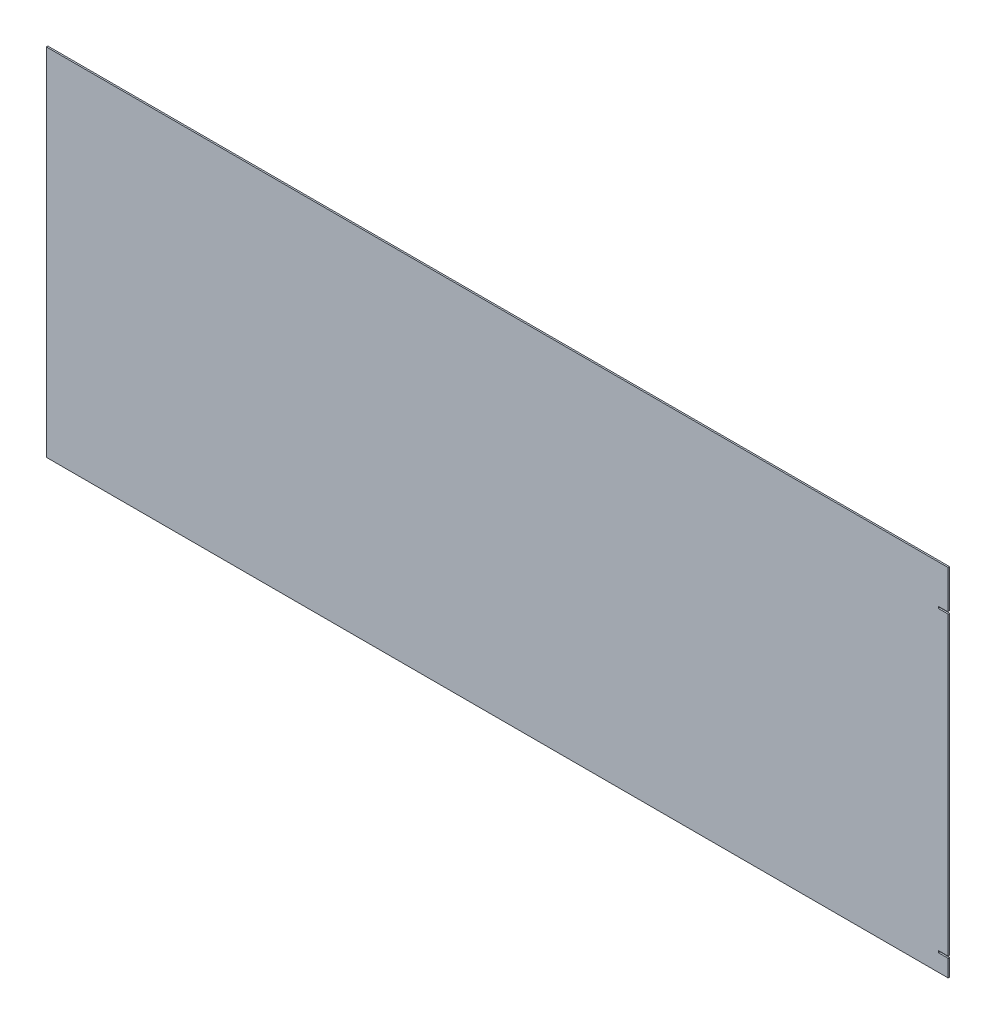
ISO-10303-21;
HEADER;
FILE_DESCRIPTION(('STEP AP214'),'2;1');
FILE_NAME('part.step','',(''),(''),'','','');
FILE_SCHEMA(('AUTOMOTIVE_DESIGN { 1 0 10303 214 1 1 1 1 }'));
ENDSEC;
DATA;
#1=APPLICATION_CONTEXT('core data for automotive mechanical design processes');
#2=APPLICATION_PROTOCOL_DEFINITION('international standard','automotive_design',2000,#1);
#3=PRODUCT_CONTEXT('',#1,'mechanical');
#4=PRODUCT('Part','Part','',(#3));
#5=PRODUCT_RELATED_PRODUCT_CATEGORY('part','',(#4));
#6=PRODUCT_DEFINITION_FORMATION('','',#4);
#7=PRODUCT_DEFINITION_CONTEXT('part definition',#1,'design');
#8=PRODUCT_DEFINITION('design','',#6,#7);
#9=PRODUCT_DEFINITION_SHAPE('','',#8);
#10=(LENGTH_UNIT() NAMED_UNIT(*) SI_UNIT(.MILLI.,.METRE.));
#11=(NAMED_UNIT(*) PLANE_ANGLE_UNIT() SI_UNIT($,.RADIAN.));
#12=(NAMED_UNIT(*) SI_UNIT($,.STERADIAN.) SOLID_ANGLE_UNIT());
#13=UNCERTAINTY_MEASURE_WITH_UNIT(LENGTH_MEASURE(1.E-05),#10,'distance_accuracy_value','');
#14=(GEOMETRIC_REPRESENTATION_CONTEXT(3) GLOBAL_UNCERTAINTY_ASSIGNED_CONTEXT((#13)) GLOBAL_UNIT_ASSIGNED_CONTEXT((#10,
#11,#12)) REPRESENTATION_CONTEXT('',''));
#15=CARTESIAN_POINT('',(0.,0.,0.));
#16=DIRECTION('',(0.,0.,1.));
#17=DIRECTION('',(1.,0.,0.));
#18=AXIS2_PLACEMENT_3D('',#15,#16,#17);
#19=CARTESIAN_POINT('',(600.,-236.5,-2.));
#20=DIRECTION('',(1.,0.,0.));
#21=DIRECTION('',(0.,0.,-1.));
#22=AXIS2_PLACEMENT_3D('',#19,#20,#21);
#23=PLANE('',#22);
#24=DIRECTION('',(0.,1.,0.));
#25=VECTOR('',#24,1.);
#26=CARTESIAN_POINT('',(600.,-236.5,0.));
#27=LINE('',#26,#25);
#28=CARTESIAN_POINT('',(600.,186.050514081919,0.));
#29=VERTEX_POINT('',#28);
#30=CARTESIAN_POINT('',(600.,236.5,0.));
#31=VERTEX_POINT('',#30);
#32=EDGE_CURVE('E240',#29,#31,#27,.T.);
#33=ORIENTED_EDGE('',*,*,#32,.F.);
#34=DIRECTION('',(0.,0.,1.));
#35=VECTOR('',#34,1.);
#36=CARTESIAN_POINT('',(600.,186.050514081919,-2.));
#37=LINE('',#36,#35);
#38=CARTESIAN_POINT('',(600.,186.050514081919,-2.));
#39=VERTEX_POINT('',#38);
#40=EDGE_CURVE('E11',#29,#39,#37,.F.);
#41=ORIENTED_EDGE('',*,*,#40,.T.);
#42=DIRECTION('',(0.,1.,0.));
#43=VECTOR('',#42,1.);
#44=CARTESIAN_POINT('',(600.,-236.5,-2.));
#45=LINE('',#44,#43);
#46=CARTESIAN_POINT('',(600.,236.5,-2.));
#47=VERTEX_POINT('',#46);
#48=EDGE_CURVE('E220',#39,#47,#45,.T.);
#49=ORIENTED_EDGE('',*,*,#48,.T.);
#50=DIRECTION('',(0.,0.,1.));
#51=VECTOR('',#50,1.);
#52=CARTESIAN_POINT('',(600.,236.5,-2.));
#53=LINE('',#52,#51);
#54=EDGE_CURVE('E251',#47,#31,#53,.T.);
#55=ORIENTED_EDGE('',*,*,#54,.T.);
#56=EDGE_LOOP('',(#33,#41,#49,#55));
#57=FACE_BOUND('',#56,.T.);
#58=ADVANCED_FACE('F42',(#57),#23,.T.);
#59=DIRECTION('',(0.,0.,-1.));
#60=VECTOR('',#59,1.);
#61=CARTESIAN_POINT('',(600.,182.810514081919,0.));
#62=LINE('',#61,#60);
#63=CARTESIAN_POINT('',(600.,182.810514081919,0.));
#64=VERTEX_POINT('',#63);
#65=CARTESIAN_POINT('',(600.,182.810514081919,-2.));
#66=VERTEX_POINT('',#65);
#67=EDGE_CURVE('E162',#64,#66,#62,.T.);
#68=ORIENTED_EDGE('',*,*,#67,.F.);
#69=CARTESIAN_POINT('',(600.,-211.320674279277,0.));
#70=VERTEX_POINT('',#69);
#71=EDGE_CURVE('E169',#70,#64,#27,.T.);
#72=ORIENTED_EDGE('',*,*,#71,.F.);
#73=DIRECTION('',(0.,0.,1.));
#74=VECTOR('',#73,1.);
#75=CARTESIAN_POINT('',(600.,-211.320674279277,0.));
#76=LINE('',#75,#74);
#77=CARTESIAN_POINT('',(600.,-211.320674279277,-2.));
#78=VERTEX_POINT('',#77);
#79=EDGE_CURVE('E195',#78,#70,#76,.T.);
#80=ORIENTED_EDGE('',*,*,#79,.F.);
#81=EDGE_CURVE('E226',#78,#66,#45,.T.);
#82=ORIENTED_EDGE('',*,*,#81,.T.);
#83=EDGE_LOOP('',(#68,#72,#80,#82));
#84=FACE_BOUND('',#83,.T.);
#85=ADVANCED_FACE('F321',(#84),#23,.T.);
#86=CARTESIAN_POINT('',(-600.,-236.5,-2.));
#87=DIRECTION('',(-1.,0.,0.));
#88=DIRECTION('',(0.,0.,1.));
#89=AXIS2_PLACEMENT_3D('',#86,#87,#88);
#90=PLANE('',#89);
#91=DIRECTION('',(0.,-1.,0.));
#92=VECTOR('',#91,1.);
#93=CARTESIAN_POINT('',(-600.,-236.5,0.));
#94=LINE('',#93,#92);
#95=CARTESIAN_POINT('',(-600.,236.5,0.));
#96=VERTEX_POINT('',#95);
#97=CARTESIAN_POINT('',(-600.,-236.5,0.));
#98=VERTEX_POINT('',#97);
#99=EDGE_CURVE('E231',#96,#98,#94,.T.);
#100=ORIENTED_EDGE('',*,*,#99,.F.);
#101=DIRECTION('',(0.,0.,1.));
#102=VECTOR('',#101,1.);
#103=CARTESIAN_POINT('',(-600.,236.5,-2.));
#104=LINE('',#103,#102);
#105=CARTESIAN_POINT('',(-600.,236.5,-2.));
#106=VERTEX_POINT('',#105);
#107=EDGE_CURVE('E247',#106,#96,#104,.T.);
#108=ORIENTED_EDGE('',*,*,#107,.F.);
#109=DIRECTION('',(0.,-1.,0.));
#110=VECTOR('',#109,1.);
#111=CARTESIAN_POINT('',(-600.,-236.5,-2.));
#112=LINE('',#111,#110);
#113=CARTESIAN_POINT('',(-600.,-236.5,-2.));
#114=VERTEX_POINT('',#113);
#115=EDGE_CURVE('E211',#106,#114,#112,.T.);
#116=ORIENTED_EDGE('',*,*,#115,.T.);
#117=DIRECTION('',(0.,0.,1.));
#118=VECTOR('',#117,1.);
#119=CARTESIAN_POINT('',(-600.,-236.5,-2.));
#120=LINE('',#119,#118);
#121=EDGE_CURVE('E230',#114,#98,#120,.T.);
#122=ORIENTED_EDGE('',*,*,#121,.T.);
#123=EDGE_LOOP('',(#100,#108,#116,#122));
#124=FACE_BOUND('',#123,.T.);
#125=ADVANCED_FACE('F350',(#124),#90,.T.);
#126=CARTESIAN_POINT('',(600.,236.5,-2.));
#127=DIRECTION('',(0.,1.,0.));
#128=DIRECTION('',(-1.,0.,0.));
#129=AXIS2_PLACEMENT_3D('',#126,#127,#128);
#130=PLANE('',#129);
#131=DIRECTION('',(-1.,0.,0.));
#132=VECTOR('',#131,1.);
#133=CARTESIAN_POINT('',(600.,236.5,0.));
#134=LINE('',#133,#132);
#135=EDGE_CURVE('E216',#31,#96,#134,.T.);
#136=ORIENTED_EDGE('',*,*,#135,.F.);
#137=ORIENTED_EDGE('',*,*,#54,.F.);
#138=DIRECTION('',(-1.,0.,0.));
#139=VECTOR('',#138,1.);
#140=CARTESIAN_POINT('',(600.,236.5,-2.));
#141=LINE('',#140,#139);
#142=EDGE_CURVE('E225',#47,#106,#141,.T.);
#143=ORIENTED_EDGE('',*,*,#142,.T.);
#144=ORIENTED_EDGE('',*,*,#107,.T.);
#145=EDGE_LOOP('',(#136,#137,#143,#144));
#146=FACE_BOUND('',#145,.T.);
#147=ADVANCED_FACE('F352',(#146),#130,.T.);
#148=CARTESIAN_POINT('',(600.,-236.5,-2.));
#149=VERTEX_POINT('',#148);
#150=CARTESIAN_POINT('',(600.,-214.560674279277,-2.));
#151=VERTEX_POINT('',#150);
#152=EDGE_CURVE('E221',#149,#151,#45,.T.);
#153=ORIENTED_EDGE('',*,*,#152,.T.);
#154=DIRECTION('',(0.,0.,-1.));
#155=VECTOR('',#154,1.);
#156=CARTESIAN_POINT('',(600.,-214.560674279277,0.));
#157=LINE('',#156,#155);
#158=CARTESIAN_POINT('',(600.,-214.560674279277,0.));
#159=VERTEX_POINT('',#158);
#160=EDGE_CURVE('E269',#151,#159,#157,.F.);
#161=ORIENTED_EDGE('',*,*,#160,.T.);
#162=CARTESIAN_POINT('',(600.,-236.5,0.));
#163=VERTEX_POINT('',#162);
#164=EDGE_CURVE('E241',#163,#159,#27,.T.);
#165=ORIENTED_EDGE('',*,*,#164,.F.);
#166=DIRECTION('',(0.,0.,1.));
#167=VECTOR('',#166,1.);
#168=CARTESIAN_POINT('',(600.,-236.5,-2.));
#169=LINE('',#168,#167);
#170=EDGE_CURVE('E255',#149,#163,#169,.T.);
#171=ORIENTED_EDGE('',*,*,#170,.F.);
#172=EDGE_LOOP('',(#153,#161,#165,#171));
#173=FACE_BOUND('',#172,.T.);
#174=ADVANCED_FACE('F340',(#173),#23,.T.);
#175=CARTESIAN_POINT('',(600.,-236.5,-2.));
#176=DIRECTION('',(0.,-1.,0.));
#177=DIRECTION('',(1.,0.,0.));
#178=AXIS2_PLACEMENT_3D('',#175,#176,#177);
#179=PLANE('',#178);
#180=DIRECTION('',(1.,0.,0.));
#181=VECTOR('',#180,1.);
#182=CARTESIAN_POINT('',(600.,-236.5,0.));
#183=LINE('',#182,#181);
#184=EDGE_CURVE('E235',#98,#163,#183,.T.);
#185=ORIENTED_EDGE('',*,*,#184,.F.);
#186=ORIENTED_EDGE('',*,*,#121,.F.);
#187=DIRECTION('',(1.,0.,0.));
#188=VECTOR('',#187,1.);
#189=CARTESIAN_POINT('',(600.,-236.5,-2.));
#190=LINE('',#189,#188);
#191=EDGE_CURVE('E215',#114,#149,#190,.T.);
#192=ORIENTED_EDGE('',*,*,#191,.T.);
#193=ORIENTED_EDGE('',*,*,#170,.T.);
#194=EDGE_LOOP('',(#185,#186,#192,#193));
#195=FACE_BOUND('',#194,.T.);
#196=ADVANCED_FACE('F347',(#195),#179,.T.);
#197=CARTESIAN_POINT('',(0.,0.,-2.));
#198=DIRECTION('',(0.,0.,1.));
#199=DIRECTION('',(1.,0.,0.));
#200=AXIS2_PLACEMENT_3D('',#197,#198,#199);
#201=PLANE('',#200);
#202=DIRECTION('',(1.,0.,0.));
#203=VECTOR('',#202,1.);
#204=CARTESIAN_POINT('',(587.,-213.820674279277,-2.));
#205=LINE('',#204,#203);
#206=CARTESIAN_POINT('',(587.,-213.820674279277,-2.));
#207=VERTEX_POINT('',#206);
#208=CARTESIAN_POINT('',(599.26,-213.820674279277,-2.));
#209=VERTEX_POINT('',#208);
#210=EDGE_CURVE('E185',#207,#209,#205,.T.);
#211=ORIENTED_EDGE('',*,*,#210,.T.);
#212=CARTESIAN_POINT('',(599.26,-214.560674279277,-2.));
#213=DIRECTION('',(0.,0.,1.));
#214=DIRECTION('',(1.,0.,0.));
#215=AXIS2_PLACEMENT_3D('',#212,#213,#214);
#216=CIRCLE('',#215,0.74);
#217=EDGE_CURVE('E266',#209,#151,#216,.F.);
#218=ORIENTED_EDGE('',*,*,#217,.T.);
#219=ORIENTED_EDGE('',*,*,#152,.F.);
#220=ORIENTED_EDGE('',*,*,#191,.F.);
#221=ORIENTED_EDGE('',*,*,#115,.F.);
#222=ORIENTED_EDGE('',*,*,#142,.F.);
#223=ORIENTED_EDGE('',*,*,#48,.F.);
#224=CARTESIAN_POINT('',(599.26,186.050514081919,-2.));
#225=DIRECTION('',(0.,0.,1.));
#226=DIRECTION('',(1.,0.,0.));
#227=AXIS2_PLACEMENT_3D('',#224,#225,#226);
#228=CIRCLE('',#227,0.74);
#229=CARTESIAN_POINT('',(599.26,185.310514081919,-2.));
#230=VERTEX_POINT('',#229);
#231=EDGE_CURVE('E263',#39,#230,#228,.F.);
#232=ORIENTED_EDGE('',*,*,#231,.T.);
#233=DIRECTION('',(1.,0.,0.));
#234=VECTOR('',#233,1.);
#235=CARTESIAN_POINT('',(587.,185.310514081919,-2.));
#236=LINE('',#235,#234);
#237=CARTESIAN_POINT('',(587.,185.310514081919,-2.));
#238=VERTEX_POINT('',#237);
#239=EDGE_CURVE('E174',#238,#230,#236,.T.);
#240=ORIENTED_EDGE('',*,*,#239,.F.);
#241=DIRECTION('',(0.,1.,0.));
#242=VECTOR('',#241,1.);
#243=CARTESIAN_POINT('',(587.,185.310514081919,-2.));
#244=LINE('',#243,#242);
#245=CARTESIAN_POINT('',(587.,182.810514081919,-2.));
#246=VERTEX_POINT('',#245);
#247=EDGE_CURVE('E153',#246,#238,#244,.T.);
#248=ORIENTED_EDGE('',*,*,#247,.F.);
#249=DIRECTION('',(1.,0.,0.));
#250=VECTOR('',#249,1.);
#251=CARTESIAN_POINT('',(587.,182.810514081919,-2.));
#252=LINE('',#251,#250);
#253=EDGE_CURVE('E149',#246,#66,#252,.T.);
#254=ORIENTED_EDGE('',*,*,#253,.T.);
#255=ORIENTED_EDGE('',*,*,#81,.F.);
#256=DIRECTION('',(1.,0.,0.));
#257=VECTOR('',#256,1.);
#258=CARTESIAN_POINT('',(587.,-211.320674279277,-2.));
#259=LINE('',#258,#257);
#260=CARTESIAN_POINT('',(587.,-211.320674279277,-2.));
#261=VERTEX_POINT('',#260);
#262=EDGE_CURVE('E189',#261,#78,#259,.T.);
#263=ORIENTED_EDGE('',*,*,#262,.F.);
#264=DIRECTION('',(0.,1.,0.));
#265=VECTOR('',#264,1.);
#266=CARTESIAN_POINT('',(587.,-211.320674279277,-2.));
#267=LINE('',#266,#265);
#268=EDGE_CURVE('E201',#207,#261,#267,.T.);
#269=ORIENTED_EDGE('',*,*,#268,.F.);
#270=EDGE_LOOP('',(#211,#218,#219,#220,#221,#222,#223,#232,#240,#248,#254,#255,#263,#269));
#271=FACE_BOUND('',#270,.T.);
#272=ADVANCED_FACE('F294',(#271),#201,.F.);
#273=CARTESIAN_POINT('',(0.,0.,0.));
#274=DIRECTION('',(0.,0.,1.));
#275=DIRECTION('',(1.,0.,0.));
#276=AXIS2_PLACEMENT_3D('',#273,#274,#275);
#277=PLANE('',#276);
#278=ORIENTED_EDGE('',*,*,#164,.T.);
#279=CARTESIAN_POINT('',(599.26,-214.560674279277,0.));
#280=DIRECTION('',(0.,0.,1.));
#281=DIRECTION('',(1.,0.,0.));
#282=AXIS2_PLACEMENT_3D('',#279,#280,#281);
#283=CIRCLE('',#282,0.74);
#284=CARTESIAN_POINT('',(599.26,-213.820674279277,0.));
#285=VERTEX_POINT('',#284);
#286=EDGE_CURVE('E274',#159,#285,#283,.T.);
#287=ORIENTED_EDGE('',*,*,#286,.T.);
#288=DIRECTION('',(1.,0.,0.));
#289=VECTOR('',#288,1.);
#290=CARTESIAN_POINT('',(587.,-213.820674279277,0.));
#291=LINE('',#290,#289);
#292=CARTESIAN_POINT('',(587.,-213.820674279277,0.));
#293=VERTEX_POINT('',#292);
#294=EDGE_CURVE('E180',#293,#285,#291,.T.);
#295=ORIENTED_EDGE('',*,*,#294,.F.);
#296=DIRECTION('',(0.,-1.,0.));
#297=VECTOR('',#296,1.);
#298=CARTESIAN_POINT('',(587.,-211.320674279277,0.));
#299=LINE('',#298,#297);
#300=CARTESIAN_POINT('',(587.,-211.320674279277,0.));
#301=VERTEX_POINT('',#300);
#302=EDGE_CURVE('E198',#301,#293,#299,.T.);
#303=ORIENTED_EDGE('',*,*,#302,.F.);
#304=DIRECTION('',(1.,0.,0.));
#305=VECTOR('',#304,1.);
#306=CARTESIAN_POINT('',(587.,-211.320674279277,0.));
#307=LINE('',#306,#305);
#308=EDGE_CURVE('E192',#301,#70,#307,.T.);
#309=ORIENTED_EDGE('',*,*,#308,.T.);
#310=ORIENTED_EDGE('',*,*,#71,.T.);
#311=DIRECTION('',(1.,0.,0.));
#312=VECTOR('',#311,1.);
#313=CARTESIAN_POINT('',(587.,182.810514081919,0.));
#314=LINE('',#313,#312);
#315=CARTESIAN_POINT('',(587.,182.810514081919,0.));
#316=VERTEX_POINT('',#315);
#317=EDGE_CURVE('E146',#316,#64,#314,.T.);
#318=ORIENTED_EDGE('',*,*,#317,.F.);
#319=DIRECTION('',(0.,-1.,0.));
#320=VECTOR('',#319,1.);
#321=CARTESIAN_POINT('',(587.,185.310514081919,0.));
#322=LINE('',#321,#320);
#323=CARTESIAN_POINT('',(587.,185.310514081919,0.));
#324=VERTEX_POINT('',#323);
#325=EDGE_CURVE('E154',#324,#316,#322,.T.);
#326=ORIENTED_EDGE('',*,*,#325,.F.);
#327=DIRECTION('',(1.,0.,0.));
#328=VECTOR('',#327,1.);
#329=CARTESIAN_POINT('',(587.,185.310514081919,0.));
#330=LINE('',#329,#328);
#331=CARTESIAN_POINT('',(599.26,185.310514081919,0.));
#332=VERTEX_POINT('',#331);
#333=EDGE_CURVE('E236',#324,#332,#330,.T.);
#334=ORIENTED_EDGE('',*,*,#333,.T.);
#335=CARTESIAN_POINT('',(599.26,186.050514081919,0.));
#336=DIRECTION('',(0.,0.,1.));
#337=DIRECTION('',(1.,0.,0.));
#338=AXIS2_PLACEMENT_3D('',#335,#336,#337);
#339=CIRCLE('',#338,0.74);
#340=EDGE_CURVE('E58',#332,#29,#339,.T.);
#341=ORIENTED_EDGE('',*,*,#340,.T.);
#342=ORIENTED_EDGE('',*,*,#32,.T.);
#343=ORIENTED_EDGE('',*,*,#135,.T.);
#344=ORIENTED_EDGE('',*,*,#99,.T.);
#345=ORIENTED_EDGE('',*,*,#184,.T.);
#346=EDGE_LOOP('',(#278,#287,#295,#303,#309,#310,#318,#326,#334,#341,#342,#343,#344,#345));
#347=FACE_BOUND('',#346,.T.);
#348=ADVANCED_FACE('F166',(#347),#277,.T.);
#349=CARTESIAN_POINT('',(587.,-211.320674279277,0.));
#350=DIRECTION('',(0.,1.,0.));
#351=DIRECTION('',(0.,0.,1.));
#352=AXIS2_PLACEMENT_3D('',#349,#350,#351);
#353=PLANE('',#352);
#354=ORIENTED_EDGE('',*,*,#79,.T.);
#355=ORIENTED_EDGE('',*,*,#308,.F.);
#356=DIRECTION('',(0.,0.,1.));
#357=VECTOR('',#356,1.);
#358=CARTESIAN_POINT('',(587.,-211.320674279277,0.));
#359=LINE('',#358,#357);
#360=EDGE_CURVE('E184',#261,#301,#359,.T.);
#361=ORIENTED_EDGE('',*,*,#360,.F.);
#362=ORIENTED_EDGE('',*,*,#262,.T.);
#363=EDGE_LOOP('',(#354,#355,#361,#362));
#364=FACE_BOUND('',#363,.T.);
#365=ADVANCED_FACE('F326',(#364),#353,.F.);
#366=CARTESIAN_POINT('',(587.,-213.820674279277,0.));
#367=DIRECTION('',(0.,-1.,0.));
#368=DIRECTION('',(0.,0.,-1.));
#369=AXIS2_PLACEMENT_3D('',#366,#367,#368);
#370=PLANE('',#369);
#371=ORIENTED_EDGE('',*,*,#294,.T.);
#372=DIRECTION('',(0.,0.,-1.));
#373=VECTOR('',#372,1.);
#374=CARTESIAN_POINT('',(599.26,-213.820674279277,-2.));
#375=LINE('',#374,#373);
#376=EDGE_CURVE('E250',#285,#209,#375,.T.);
#377=ORIENTED_EDGE('',*,*,#376,.T.);
#378=ORIENTED_EDGE('',*,*,#210,.F.);
#379=DIRECTION('',(0.,0.,-1.));
#380=VECTOR('',#379,1.);
#381=CARTESIAN_POINT('',(587.,-213.820674279277,0.));
#382=LINE('',#381,#380);
#383=EDGE_CURVE('E204',#293,#207,#382,.T.);
#384=ORIENTED_EDGE('',*,*,#383,.F.);
#385=EDGE_LOOP('',(#371,#377,#378,#384));
#386=FACE_BOUND('',#385,.T.);
#387=ADVANCED_FACE('F333',(#386),#370,.F.);
#388=CARTESIAN_POINT('',(587.,0.,0.));
#389=DIRECTION('',(1.,0.,0.));
#390=DIRECTION('',(0.,0.,-1.));
#391=AXIS2_PLACEMENT_3D('',#388,#389,#390);
#392=PLANE('',#391);
#393=ORIENTED_EDGE('',*,*,#302,.T.);
#394=ORIENTED_EDGE('',*,*,#383,.T.);
#395=ORIENTED_EDGE('',*,*,#268,.T.);
#396=ORIENTED_EDGE('',*,*,#360,.T.);
#397=EDGE_LOOP('',(#393,#394,#395,#396));
#398=FACE_BOUND('',#397,.T.);
#399=ADVANCED_FACE('F330',(#398),#392,.T.);
#400=CARTESIAN_POINT('',(587.,185.310514081919,0.));
#401=DIRECTION('',(0.,1.,0.));
#402=DIRECTION('',(0.,0.,1.));
#403=AXIS2_PLACEMENT_3D('',#400,#401,#402);
#404=PLANE('',#403);
#405=ORIENTED_EDGE('',*,*,#239,.T.);
#406=DIRECTION('',(0.,0.,1.));
#407=VECTOR('',#406,1.);
#408=CARTESIAN_POINT('',(599.26,185.310514081919,0.));
#409=LINE('',#408,#407);
#410=EDGE_CURVE('E51',#230,#332,#409,.T.);
#411=ORIENTED_EDGE('',*,*,#410,.T.);
#412=ORIENTED_EDGE('',*,*,#333,.F.);
#413=DIRECTION('',(0.,0.,1.));
#414=VECTOR('',#413,1.);
#415=CARTESIAN_POINT('',(587.,185.310514081919,0.));
#416=LINE('',#415,#414);
#417=EDGE_CURVE('E159',#238,#324,#416,.T.);
#418=ORIENTED_EDGE('',*,*,#417,.F.);
#419=EDGE_LOOP('',(#405,#411,#412,#418));
#420=FACE_BOUND('',#419,.T.);
#421=ADVANCED_FACE('F280',(#420),#404,.F.);
#422=CARTESIAN_POINT('',(587.,182.810514081919,0.));
#423=DIRECTION('',(0.,-1.,0.));
#424=DIRECTION('',(0.,0.,-1.));
#425=AXIS2_PLACEMENT_3D('',#422,#423,#424);
#426=PLANE('',#425);
#427=ORIENTED_EDGE('',*,*,#67,.T.);
#428=ORIENTED_EDGE('',*,*,#253,.F.);
#429=DIRECTION('',(0.,0.,-1.));
#430=VECTOR('',#429,1.);
#431=CARTESIAN_POINT('',(587.,182.810514081919,0.));
#432=LINE('',#431,#430);
#433=EDGE_CURVE('E142',#316,#246,#432,.T.);
#434=ORIENTED_EDGE('',*,*,#433,.F.);
#435=ORIENTED_EDGE('',*,*,#317,.T.);
#436=EDGE_LOOP('',(#427,#428,#434,#435));
#437=FACE_BOUND('',#436,.T.);
#438=ADVANCED_FACE('F144',(#437),#426,.F.);
#439=CARTESIAN_POINT('',(587.,0.,0.));
#440=DIRECTION('',(1.,0.,0.));
#441=DIRECTION('',(0.,0.,-1.));
#442=AXIS2_PLACEMENT_3D('',#439,#440,#441);
#443=PLANE('',#442);
#444=ORIENTED_EDGE('',*,*,#325,.T.);
#445=ORIENTED_EDGE('',*,*,#433,.T.);
#446=ORIENTED_EDGE('',*,*,#247,.T.);
#447=ORIENTED_EDGE('',*,*,#417,.T.);
#448=EDGE_LOOP('',(#444,#445,#446,#447));
#449=FACE_BOUND('',#448,.T.);
#450=ADVANCED_FACE('F157',(#449),#443,.T.);
#451=CARTESIAN_POINT('',(599.26,-214.560674279277,0.));
#452=DIRECTION('',(0.,0.,1.));
#453=DIRECTION('',(1.,0.,0.));
#454=AXIS2_PLACEMENT_3D('',#451,#452,#453);
#455=CYLINDRICAL_SURFACE('',#454,0.74);
#456=ORIENTED_EDGE('',*,*,#286,.F.);
#457=ORIENTED_EDGE('',*,*,#160,.F.);
#458=ORIENTED_EDGE('',*,*,#217,.F.);
#459=ORIENTED_EDGE('',*,*,#376,.F.);
#460=EDGE_LOOP('',(#456,#457,#458,#459));
#461=FACE_BOUND('',#460,.T.);
#462=ADVANCED_FACE('F343',(#461),#455,.T.);
#463=CARTESIAN_POINT('',(599.26,186.050514081919,0.));
#464=DIRECTION('',(0.,0.,-1.));
#465=DIRECTION('',(-1.,0.,0.));
#466=AXIS2_PLACEMENT_3D('',#463,#464,#465);
#467=CYLINDRICAL_SURFACE('',#466,0.74);
#468=ORIENTED_EDGE('',*,*,#231,.F.);
#469=ORIENTED_EDGE('',*,*,#40,.F.);
#470=ORIENTED_EDGE('',*,*,#340,.F.);
#471=ORIENTED_EDGE('',*,*,#410,.F.);
#472=EDGE_LOOP('',(#468,#469,#470,#471));
#473=FACE_BOUND('',#472,.T.);
#474=ADVANCED_FACE('F44',(#473),#467,.T.);
#475=CLOSED_SHELL('',(#58,#85,#125,#147,#174,#196,#272,#348,#365,#387,#399,#421,#438,#450,#462,#474));
#476=MANIFOLD_SOLID_BREP('B2',#475);
#477=ADVANCED_BREP_SHAPE_REPRESENTATION('',(#18,#476),#14);
#478=SHAPE_DEFINITION_REPRESENTATION(#9,#477);
ENDSEC;
END-ISO-10303-21;
